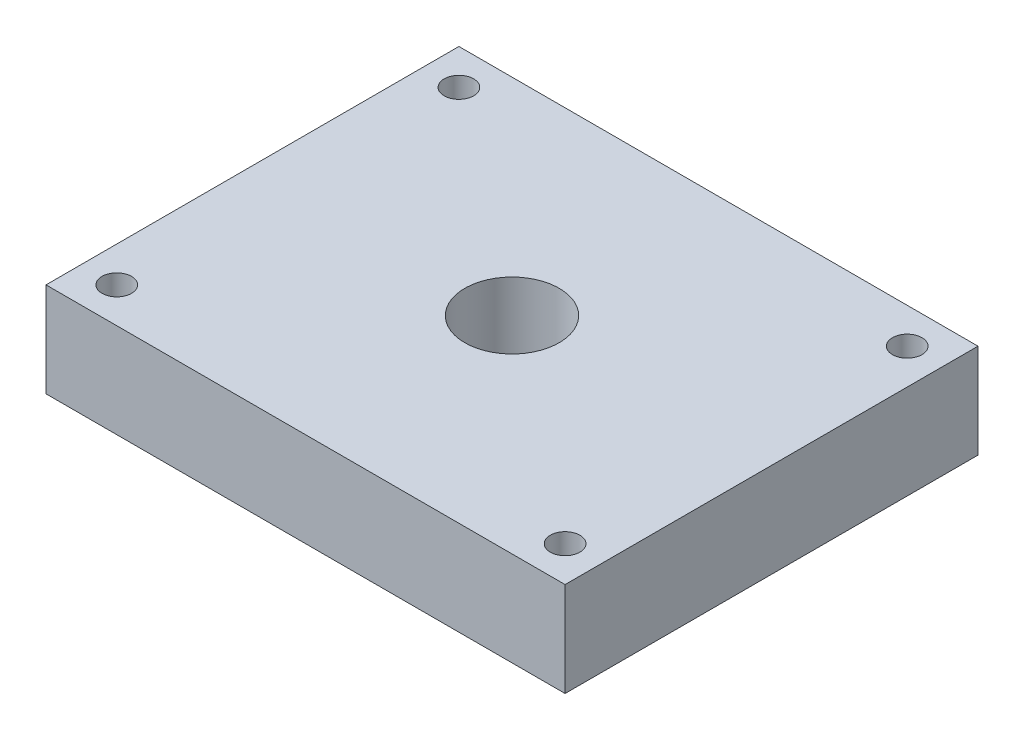
ISO-10303-21;
HEADER;
FILE_DESCRIPTION(('STEP AP214'),'2;1');
FILE_NAME('part.step','',(''),(''),'','','');
FILE_SCHEMA(('AUTOMOTIVE_DESIGN { 1 0 10303 214 1 1 1 1 }'));
ENDSEC;
DATA;
#1=APPLICATION_CONTEXT('core data for automotive mechanical design processes');
#2=APPLICATION_PROTOCOL_DEFINITION('international standard','automotive_design',2000,#1);
#3=PRODUCT_CONTEXT('',#1,'mechanical');
#4=PRODUCT('Part','Part','',(#3));
#5=PRODUCT_RELATED_PRODUCT_CATEGORY('part','',(#4));
#6=PRODUCT_DEFINITION_FORMATION('','',#4);
#7=PRODUCT_DEFINITION_CONTEXT('part definition',#1,'design');
#8=PRODUCT_DEFINITION('design','',#6,#7);
#9=PRODUCT_DEFINITION_SHAPE('','',#8);
#10=(LENGTH_UNIT() NAMED_UNIT(*) SI_UNIT(.MILLI.,.METRE.));
#11=(NAMED_UNIT(*) PLANE_ANGLE_UNIT() SI_UNIT($,.RADIAN.));
#12=(NAMED_UNIT(*) SI_UNIT($,.STERADIAN.) SOLID_ANGLE_UNIT());
#13=UNCERTAINTY_MEASURE_WITH_UNIT(LENGTH_MEASURE(1.E-05),#10,'distance_accuracy_value','');
#14=(GEOMETRIC_REPRESENTATION_CONTEXT(3) GLOBAL_UNCERTAINTY_ASSIGNED_CONTEXT((#13)) GLOBAL_UNIT_ASSIGNED_CONTEXT((#10,
#11,#12)) REPRESENTATION_CONTEXT('',''));
#15=CARTESIAN_POINT('',(0.,0.,0.));
#16=DIRECTION('',(0.,0.,1.));
#17=DIRECTION('',(1.,0.,0.));
#18=AXIS2_PLACEMENT_3D('',#15,#16,#17);
#19=CARTESIAN_POINT('',(0.,8.,0.));
#20=DIRECTION('',(0.,1.,0.));
#21=DIRECTION('',(0.,0.,1.));
#22=AXIS2_PLACEMENT_3D('',#19,#20,#21);
#23=PLANE('',#22);
#24=CARTESIAN_POINT('',(0.,8.,0.));
#25=DIRECTION('',(0.,1.,0.));
#26=DIRECTION('',(0.,0.,1.));
#27=AXIS2_PLACEMENT_3D('',#24,#25,#26);
#28=CIRCLE('',#27,4.);
#29=CARTESIAN_POINT('',(0.,8.,4.));
#30=VERTEX_POINT('',#29);
#31=EDGE_CURVE('E136',#30,#30,#28,.T.);
#32=ORIENTED_EDGE('',*,*,#31,.F.);
#33=EDGE_LOOP('',(#32));
#34=FACE_BOUND('',#33,.T.);
#35=CARTESIAN_POINT('',(19.0000000000001,8.,14.5));
#36=DIRECTION('',(0.,1.,0.));
#37=DIRECTION('',(0.,0.,1.));
#38=AXIS2_PLACEMENT_3D('',#35,#36,#37);
#39=CIRCLE('',#38,1.25);
#40=CARTESIAN_POINT('',(19.0000000000001,8.,15.75));
#41=VERTEX_POINT('',#40);
#42=EDGE_CURVE('E124',#41,#41,#39,.T.);
#43=ORIENTED_EDGE('',*,*,#42,.F.);
#44=EDGE_LOOP('',(#43));
#45=FACE_BOUND('',#44,.T.);
#46=CARTESIAN_POINT('',(-18.9999999999999,8.,14.5));
#47=DIRECTION('',(0.,1.,0.));
#48=DIRECTION('',(0.,0.,1.));
#49=AXIS2_PLACEMENT_3D('',#46,#47,#48);
#50=CIRCLE('',#49,1.25);
#51=CARTESIAN_POINT('',(-18.9999999999999,8.,15.75));
#52=VERTEX_POINT('',#51);
#53=EDGE_CURVE('E103',#52,#52,#50,.T.);
#54=ORIENTED_EDGE('',*,*,#53,.F.);
#55=EDGE_LOOP('',(#54));
#56=FACE_BOUND('',#55,.T.);
#57=DIRECTION('',(0.,0.,1.));
#58=VECTOR('',#57,1.);
#59=CARTESIAN_POINT('',(-22.,8.,17.5));
#60=LINE('',#59,#58);
#61=CARTESIAN_POINT('',(-22.,8.,-17.5));
#62=VERTEX_POINT('',#61);
#63=CARTESIAN_POINT('',(-22.,8.,17.5));
#64=VERTEX_POINT('',#63);
#65=EDGE_CURVE('E88',#62,#64,#60,.T.);
#66=ORIENTED_EDGE('',*,*,#65,.T.);
#67=DIRECTION('',(1.,0.,0.));
#68=VECTOR('',#67,1.);
#69=CARTESIAN_POINT('',(22.,8.,17.5));
#70=LINE('',#69,#68);
#71=CARTESIAN_POINT('',(22.,8.,17.5));
#72=VERTEX_POINT('',#71);
#73=EDGE_CURVE('E83',#64,#72,#70,.T.);
#74=ORIENTED_EDGE('',*,*,#73,.T.);
#75=DIRECTION('',(0.,0.,-1.));
#76=VECTOR('',#75,1.);
#77=CARTESIAN_POINT('',(22.,8.,17.5));
#78=LINE('',#77,#76);
#79=CARTESIAN_POINT('',(22.,8.,-17.5));
#80=VERTEX_POINT('',#79);
#81=EDGE_CURVE('E86',#72,#80,#78,.T.);
#82=ORIENTED_EDGE('',*,*,#81,.T.);
#83=DIRECTION('',(-1.,0.,0.));
#84=VECTOR('',#83,1.);
#85=CARTESIAN_POINT('',(22.,8.,-17.5));
#86=LINE('',#85,#84);
#87=EDGE_CURVE('E53',#80,#62,#86,.T.);
#88=ORIENTED_EDGE('',*,*,#87,.T.);
#89=EDGE_LOOP('',(#66,#74,#82,#88));
#90=FACE_BOUND('',#89,.T.);
#91=CARTESIAN_POINT('',(-19.0000000000002,8.,-14.5));
#92=DIRECTION('',(0.,1.,0.));
#93=DIRECTION('',(0.,0.,1.));
#94=AXIS2_PLACEMENT_3D('',#91,#92,#93);
#95=CIRCLE('',#94,1.25);
#96=CARTESIAN_POINT('',(-19.0000000000002,8.,-13.25));
#97=VERTEX_POINT('',#96);
#98=EDGE_CURVE('E118',#97,#97,#95,.T.);
#99=ORIENTED_EDGE('',*,*,#98,.F.);
#100=EDGE_LOOP('',(#99));
#101=FACE_BOUND('',#100,.T.);
#102=CARTESIAN_POINT('',(18.9999999999998,8.,-14.5));
#103=DIRECTION('',(0.,1.,0.));
#104=DIRECTION('',(0.,0.,1.));
#105=AXIS2_PLACEMENT_3D('',#102,#103,#104);
#106=CIRCLE('',#105,1.25);
#107=CARTESIAN_POINT('',(18.9999999999998,8.,-13.25));
#108=VERTEX_POINT('',#107);
#109=EDGE_CURVE('E130',#108,#108,#106,.T.);
#110=ORIENTED_EDGE('',*,*,#109,.F.);
#111=EDGE_LOOP('',(#110));
#112=FACE_BOUND('',#111,.T.);
#113=ADVANCED_FACE('F36',(#34,#45,#56,#90,#101,#112),#23,.T.);
#114=CARTESIAN_POINT('',(0.,0.,0.));
#115=DIRECTION('',(0.,1.,0.));
#116=DIRECTION('',(0.,0.,1.));
#117=AXIS2_PLACEMENT_3D('',#114,#115,#116);
#118=PLANE('',#117);
#119=CARTESIAN_POINT('',(0.,0.,0.));
#120=DIRECTION('',(0.,1.,0.));
#121=DIRECTION('',(0.,0.,1.));
#122=AXIS2_PLACEMENT_3D('',#119,#120,#121);
#123=CIRCLE('',#122,4.);
#124=CARTESIAN_POINT('',(0.,0.,4.));
#125=VERTEX_POINT('',#124);
#126=EDGE_CURVE('E139',#125,#125,#123,.T.);
#127=ORIENTED_EDGE('',*,*,#126,.T.);
#128=EDGE_LOOP('',(#127));
#129=FACE_BOUND('',#128,.T.);
#130=DIRECTION('',(0.,0.,1.));
#131=VECTOR('',#130,1.);
#132=CARTESIAN_POINT('',(-22.,0.,17.5));
#133=LINE('',#132,#131);
#134=CARTESIAN_POINT('',(-22.,0.,-17.5));
#135=VERTEX_POINT('',#134);
#136=CARTESIAN_POINT('',(-22.,0.,17.5));
#137=VERTEX_POINT('',#136);
#138=EDGE_CURVE('E100',#135,#137,#133,.T.);
#139=ORIENTED_EDGE('',*,*,#138,.F.);
#140=DIRECTION('',(-1.,0.,0.));
#141=VECTOR('',#140,1.);
#142=CARTESIAN_POINT('',(22.,0.,-17.5));
#143=LINE('',#142,#141);
#144=CARTESIAN_POINT('',(22.,0.,-17.5));
#145=VERTEX_POINT('',#144);
#146=EDGE_CURVE('E76',#145,#135,#143,.T.);
#147=ORIENTED_EDGE('',*,*,#146,.F.);
#148=DIRECTION('',(0.,0.,-1.));
#149=VECTOR('',#148,1.);
#150=CARTESIAN_POINT('',(22.,0.,17.5));
#151=LINE('',#150,#149);
#152=CARTESIAN_POINT('',(22.,0.,17.5));
#153=VERTEX_POINT('',#152);
#154=EDGE_CURVE('E70',#153,#145,#151,.T.);
#155=ORIENTED_EDGE('',*,*,#154,.F.);
#156=DIRECTION('',(1.,0.,0.));
#157=VECTOR('',#156,1.);
#158=CARTESIAN_POINT('',(22.,0.,17.5));
#159=LINE('',#158,#157);
#160=EDGE_CURVE('E92',#137,#153,#159,.T.);
#161=ORIENTED_EDGE('',*,*,#160,.F.);
#162=EDGE_LOOP('',(#139,#147,#155,#161));
#163=FACE_BOUND('',#162,.T.);
#164=CARTESIAN_POINT('',(-18.9999999999999,0.,14.5));
#165=DIRECTION('',(0.,1.,0.));
#166=DIRECTION('',(0.,0.,1.));
#167=AXIS2_PLACEMENT_3D('',#164,#165,#166);
#168=CIRCLE('',#167,1.25);
#169=CARTESIAN_POINT('',(-18.9999999999999,0.,15.75));
#170=VERTEX_POINT('',#169);
#171=EDGE_CURVE('E115',#170,#170,#168,.T.);
#172=ORIENTED_EDGE('',*,*,#171,.T.);
#173=EDGE_LOOP('',(#172));
#174=FACE_BOUND('',#173,.T.);
#175=CARTESIAN_POINT('',(-19.0000000000002,0.,-14.5));
#176=DIRECTION('',(0.,1.,0.));
#177=DIRECTION('',(0.,0.,1.));
#178=AXIS2_PLACEMENT_3D('',#175,#176,#177);
#179=CIRCLE('',#178,1.25);
#180=CARTESIAN_POINT('',(-19.0000000000002,0.,-13.25));
#181=VERTEX_POINT('',#180);
#182=EDGE_CURVE('E121',#181,#181,#179,.T.);
#183=ORIENTED_EDGE('',*,*,#182,.T.);
#184=EDGE_LOOP('',(#183));
#185=FACE_BOUND('',#184,.T.);
#186=CARTESIAN_POINT('',(19.0000000000001,0.,14.5));
#187=DIRECTION('',(0.,1.,0.));
#188=DIRECTION('',(0.,0.,1.));
#189=AXIS2_PLACEMENT_3D('',#186,#187,#188);
#190=CIRCLE('',#189,1.25);
#191=CARTESIAN_POINT('',(19.0000000000001,0.,15.75));
#192=VERTEX_POINT('',#191);
#193=EDGE_CURVE('E127',#192,#192,#190,.T.);
#194=ORIENTED_EDGE('',*,*,#193,.T.);
#195=EDGE_LOOP('',(#194));
#196=FACE_BOUND('',#195,.T.);
#197=CARTESIAN_POINT('',(18.9999999999998,0.,-14.5));
#198=DIRECTION('',(0.,1.,0.));
#199=DIRECTION('',(0.,0.,1.));
#200=AXIS2_PLACEMENT_3D('',#197,#198,#199);
#201=CIRCLE('',#200,1.25);
#202=CARTESIAN_POINT('',(18.9999999999998,0.,-13.25));
#203=VERTEX_POINT('',#202);
#204=EDGE_CURVE('E133',#203,#203,#201,.T.);
#205=ORIENTED_EDGE('',*,*,#204,.T.);
#206=EDGE_LOOP('',(#205));
#207=FACE_BOUND('',#206,.T.);
#208=ADVANCED_FACE('F111',(#129,#163,#174,#185,#196,#207),#118,.F.);
#209=CARTESIAN_POINT('',(-22.,8.,17.5));
#210=DIRECTION('',(1.,0.,0.));
#211=DIRECTION('',(0.,0.,-1.));
#212=AXIS2_PLACEMENT_3D('',#209,#210,#211);
#213=PLANE('',#212);
#214=ORIENTED_EDGE('',*,*,#138,.T.);
#215=DIRECTION('',(0.,-1.,0.));
#216=VECTOR('',#215,1.);
#217=CARTESIAN_POINT('',(-22.,8.,17.5));
#218=LINE('',#217,#216);
#219=EDGE_CURVE('E11',#64,#137,#218,.T.);
#220=ORIENTED_EDGE('',*,*,#219,.F.);
#221=ORIENTED_EDGE('',*,*,#65,.F.);
#222=DIRECTION('',(0.,-1.,0.));
#223=VECTOR('',#222,1.);
#224=CARTESIAN_POINT('',(-22.,8.,-17.5));
#225=LINE('',#224,#223);
#226=EDGE_CURVE('E96',#62,#135,#225,.T.);
#227=ORIENTED_EDGE('',*,*,#226,.T.);
#228=EDGE_LOOP('',(#214,#220,#221,#227));
#229=FACE_BOUND('',#228,.T.);
#230=ADVANCED_FACE('F38',(#229),#213,.F.);
#231=CARTESIAN_POINT('',(22.,8.,17.5));
#232=DIRECTION('',(0.,0.,-1.));
#233=DIRECTION('',(-1.,0.,0.));
#234=AXIS2_PLACEMENT_3D('',#231,#232,#233);
#235=PLANE('',#234);
#236=ORIENTED_EDGE('',*,*,#160,.T.);
#237=DIRECTION('',(0.,-1.,0.));
#238=VECTOR('',#237,1.);
#239=CARTESIAN_POINT('',(22.,8.,17.5));
#240=LINE('',#239,#238);
#241=EDGE_CURVE('E45',#72,#153,#240,.T.);
#242=ORIENTED_EDGE('',*,*,#241,.F.);
#243=ORIENTED_EDGE('',*,*,#73,.F.);
#244=ORIENTED_EDGE('',*,*,#219,.T.);
#245=EDGE_LOOP('',(#236,#242,#243,#244));
#246=FACE_BOUND('',#245,.T.);
#247=ADVANCED_FACE('F91',(#246),#235,.F.);
#248=CARTESIAN_POINT('',(22.,8.,17.5));
#249=DIRECTION('',(-1.,0.,0.));
#250=DIRECTION('',(0.,0.,1.));
#251=AXIS2_PLACEMENT_3D('',#248,#249,#250);
#252=PLANE('',#251);
#253=ORIENTED_EDGE('',*,*,#154,.T.);
#254=DIRECTION('',(0.,-1.,0.));
#255=VECTOR('',#254,1.);
#256=CARTESIAN_POINT('',(22.,8.,-17.5));
#257=LINE('',#256,#255);
#258=EDGE_CURVE('E93',#80,#145,#257,.T.);
#259=ORIENTED_EDGE('',*,*,#258,.F.);
#260=ORIENTED_EDGE('',*,*,#81,.F.);
#261=ORIENTED_EDGE('',*,*,#241,.T.);
#262=EDGE_LOOP('',(#253,#259,#260,#261));
#263=FACE_BOUND('',#262,.T.);
#264=ADVANCED_FACE('F94',(#263),#252,.F.);
#265=CARTESIAN_POINT('',(22.,8.,-17.5));
#266=DIRECTION('',(0.,0.,1.));
#267=DIRECTION('',(1.,0.,0.));
#268=AXIS2_PLACEMENT_3D('',#265,#266,#267);
#269=PLANE('',#268);
#270=ORIENTED_EDGE('',*,*,#146,.T.);
#271=ORIENTED_EDGE('',*,*,#226,.F.);
#272=ORIENTED_EDGE('',*,*,#87,.F.);
#273=ORIENTED_EDGE('',*,*,#258,.T.);
#274=EDGE_LOOP('',(#270,#271,#272,#273));
#275=FACE_BOUND('',#274,.T.);
#276=ADVANCED_FACE('F108',(#275),#269,.F.);
#277=CARTESIAN_POINT('',(-18.9999999999999,8.,14.5));
#278=DIRECTION('',(0.,-1.,0.));
#279=DIRECTION('',(0.,0.,-1.));
#280=AXIS2_PLACEMENT_3D('',#277,#278,#279);
#281=CYLINDRICAL_SURFACE('',#280,1.25);
#282=ORIENTED_EDGE('',*,*,#53,.T.);
#283=EDGE_LOOP('',(#282));
#284=FACE_BOUND('',#283,.T.);
#285=ORIENTED_EDGE('',*,*,#171,.F.);
#286=EDGE_LOOP('',(#285));
#287=FACE_BOUND('',#286,.T.);
#288=ADVANCED_FACE('F155',(#284,#287),#281,.F.);
#289=CARTESIAN_POINT('',(-19.0000000000002,8.,-14.5));
#290=DIRECTION('',(0.,-1.,0.));
#291=DIRECTION('',(0.,0.,-1.));
#292=AXIS2_PLACEMENT_3D('',#289,#290,#291);
#293=CYLINDRICAL_SURFACE('',#292,1.25);
#294=ORIENTED_EDGE('',*,*,#98,.T.);
#295=EDGE_LOOP('',(#294));
#296=FACE_BOUND('',#295,.T.);
#297=ORIENTED_EDGE('',*,*,#182,.F.);
#298=EDGE_LOOP('',(#297));
#299=FACE_BOUND('',#298,.T.);
#300=ADVANCED_FACE('F158',(#296,#299),#293,.F.);
#301=CARTESIAN_POINT('',(19.0000000000001,8.,14.5));
#302=DIRECTION('',(0.,-1.,0.));
#303=DIRECTION('',(0.,0.,-1.));
#304=AXIS2_PLACEMENT_3D('',#301,#302,#303);
#305=CYLINDRICAL_SURFACE('',#304,1.25);
#306=ORIENTED_EDGE('',*,*,#42,.T.);
#307=EDGE_LOOP('',(#306));
#308=FACE_BOUND('',#307,.T.);
#309=ORIENTED_EDGE('',*,*,#193,.F.);
#310=EDGE_LOOP('',(#309));
#311=FACE_BOUND('',#310,.T.);
#312=ADVANCED_FACE('F173',(#308,#311),#305,.F.);
#313=CARTESIAN_POINT('',(18.9999999999998,8.,-14.5));
#314=DIRECTION('',(0.,-1.,0.));
#315=DIRECTION('',(0.,0.,-1.));
#316=AXIS2_PLACEMENT_3D('',#313,#314,#315);
#317=CYLINDRICAL_SURFACE('',#316,1.25);
#318=ORIENTED_EDGE('',*,*,#109,.T.);
#319=EDGE_LOOP('',(#318));
#320=FACE_BOUND('',#319,.T.);
#321=ORIENTED_EDGE('',*,*,#204,.F.);
#322=EDGE_LOOP('',(#321));
#323=FACE_BOUND('',#322,.T.);
#324=ADVANCED_FACE('F171',(#320,#323),#317,.F.);
#325=CARTESIAN_POINT('',(0.,8.,0.));
#326=DIRECTION('',(0.,-1.,0.));
#327=DIRECTION('',(0.,0.,-1.));
#328=AXIS2_PLACEMENT_3D('',#325,#326,#327);
#329=CYLINDRICAL_SURFACE('',#328,4.);
#330=ORIENTED_EDGE('',*,*,#31,.T.);
#331=EDGE_LOOP('',(#330));
#332=FACE_BOUND('',#331,.T.);
#333=ORIENTED_EDGE('',*,*,#126,.F.);
#334=EDGE_LOOP('',(#333));
#335=FACE_BOUND('',#334,.T.);
#336=ADVANCED_FACE('F145',(#332,#335),#329,.F.);
#337=CLOSED_SHELL('',(#113,#208,#230,#247,#264,#276,#288,#300,#312,#324,#336));
#338=MANIFOLD_SOLID_BREP('B2',#337);
#339=ADVANCED_BREP_SHAPE_REPRESENTATION('',(#18,#338),#14);
#340=SHAPE_DEFINITION_REPRESENTATION(#9,#339);
ENDSEC;
END-ISO-10303-21;
